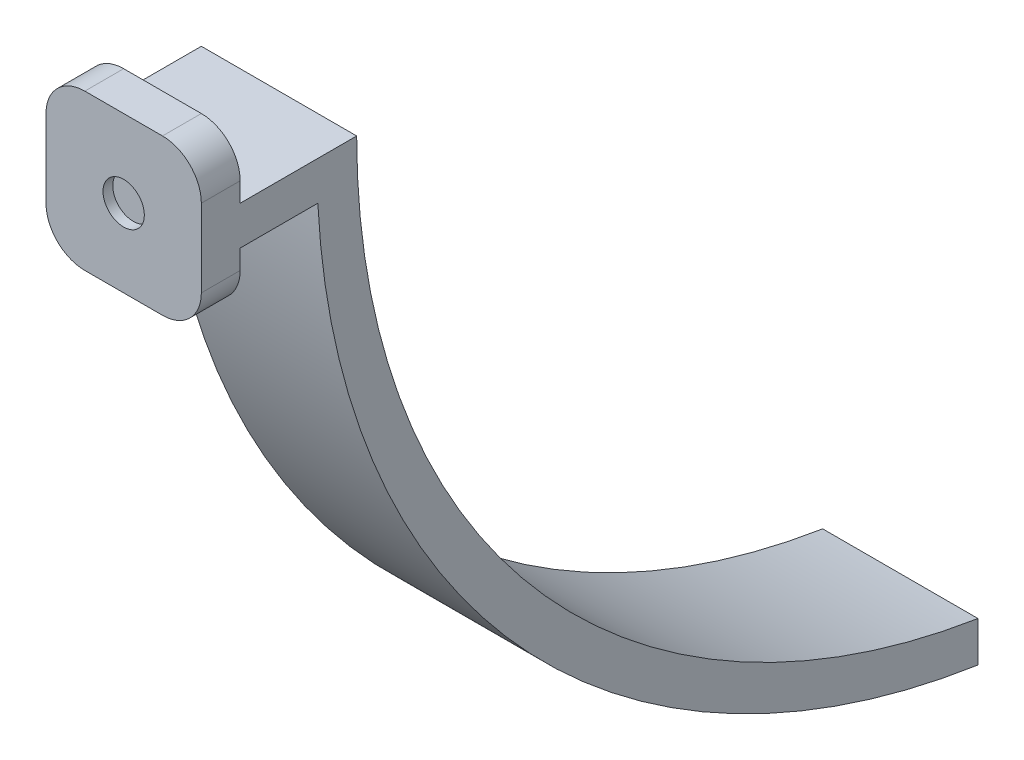
ISO-10303-21;
HEADER;
FILE_DESCRIPTION(('STEP AP214'),'2;1');
FILE_NAME('part.step','',(''),(''),'','','');
FILE_SCHEMA(('AUTOMOTIVE_DESIGN { 1 0 10303 214 1 1 1 1 }'));
ENDSEC;
DATA;
#1=APPLICATION_CONTEXT('core data for automotive mechanical design processes');
#2=APPLICATION_PROTOCOL_DEFINITION('international standard','automotive_design',2000,#1);
#3=PRODUCT_CONTEXT('',#1,'mechanical');
#4=PRODUCT('Part','Part','',(#3));
#5=PRODUCT_RELATED_PRODUCT_CATEGORY('part','',(#4));
#6=PRODUCT_DEFINITION_FORMATION('','',#4);
#7=PRODUCT_DEFINITION_CONTEXT('part definition',#1,'design');
#8=PRODUCT_DEFINITION('design','',#6,#7);
#9=PRODUCT_DEFINITION_SHAPE('','',#8);
#10=(LENGTH_UNIT() NAMED_UNIT(*) SI_UNIT(.MILLI.,.METRE.));
#11=(NAMED_UNIT(*) PLANE_ANGLE_UNIT() SI_UNIT($,.RADIAN.));
#12=(NAMED_UNIT(*) SI_UNIT($,.STERADIAN.) SOLID_ANGLE_UNIT());
#13=UNCERTAINTY_MEASURE_WITH_UNIT(LENGTH_MEASURE(1.E-05),#10,'distance_accuracy_value','');
#14=(GEOMETRIC_REPRESENTATION_CONTEXT(3) GLOBAL_UNCERTAINTY_ASSIGNED_CONTEXT((#13)) GLOBAL_UNIT_ASSIGNED_CONTEXT((#10,
#11,#12)) REPRESENTATION_CONTEXT('',''));
#15=CARTESIAN_POINT('',(0.,0.,0.));
#16=DIRECTION('',(0.,0.,1.));
#17=DIRECTION('',(1.,0.,0.));
#18=AXIS2_PLACEMENT_3D('',#15,#16,#17);
#19=CARTESIAN_POINT('',(12.7,0.,-6.35));
#20=DIRECTION('',(0.,1.,0.));
#21=DIRECTION('',(0.,0.,1.));
#22=AXIS2_PLACEMENT_3D('',#19,#20,#21);
#23=PLANE('',#22);
#24=DIRECTION('',(-1.,0.,0.));
#25=VECTOR('',#24,1.);
#26=CARTESIAN_POINT('',(12.7,0.,0.));
#27=LINE('',#26,#25);
#28=CARTESIAN_POINT('',(6.35,0.,0.));
#29=VERTEX_POINT('',#28);
#30=CARTESIAN_POINT('',(-6.35,0.,0.));
#31=VERTEX_POINT('',#30);
#32=EDGE_CURVE('E178',#29,#31,#27,.T.);
#33=ORIENTED_EDGE('',*,*,#32,.T.);
#34=DIRECTION('',(0.,0.,-1.));
#35=VECTOR('',#34,1.);
#36=CARTESIAN_POINT('',(-6.35,0.,-6.35));
#37=LINE('',#36,#35);
#38=CARTESIAN_POINT('',(-6.35,0.,-6.35));
#39=VERTEX_POINT('',#38);
#40=EDGE_CURVE('E218',#31,#39,#37,.T.);
#41=ORIENTED_EDGE('',*,*,#40,.T.);
#42=DIRECTION('',(-1.,0.,0.));
#43=VECTOR('',#42,1.);
#44=CARTESIAN_POINT('',(12.7,0.,-6.35));
#45=LINE('',#44,#43);
#46=CARTESIAN_POINT('',(6.35,0.,-6.35));
#47=VERTEX_POINT('',#46);
#48=EDGE_CURVE('E156',#47,#39,#45,.T.);
#49=ORIENTED_EDGE('',*,*,#48,.F.);
#50=DIRECTION('',(0.,0.,-1.));
#51=VECTOR('',#50,1.);
#52=CARTESIAN_POINT('',(6.35,0.,0.));
#53=LINE('',#52,#51);
#54=EDGE_CURVE('E216',#47,#29,#53,.F.);
#55=ORIENTED_EDGE('',*,*,#54,.T.);
#56=EDGE_LOOP('',(#33,#41,#49,#55));
#57=FACE_BOUND('',#56,.T.);
#58=ADVANCED_FACE('F35',(#57),#23,.F.);
#59=CARTESIAN_POINT('',(12.7,9.525,-6.34999999999999));
#60=DIRECTION('',(0.,0.,1.));
#61=DIRECTION('',(0.,-1.,0.));
#62=AXIS2_PLACEMENT_3D('',#59,#60,#61);
#63=PLANE('',#62);
#64=ORIENTED_EDGE('',*,*,#48,.T.);
#65=CARTESIAN_POINT('',(-6.35,6.35,-6.35));
#66=DIRECTION('',(0.,0.,1.));
#67=DIRECTION('',(0.,-1.,0.));
#68=AXIS2_PLACEMENT_3D('',#65,#66,#67);
#69=CIRCLE('',#68,6.35);
#70=CARTESIAN_POINT('',(-12.7,6.35,-6.35));
#71=VERTEX_POINT('',#70);
#72=EDGE_CURVE('E223',#39,#71,#69,.F.);
#73=ORIENTED_EDGE('',*,*,#72,.T.);
#74=DIRECTION('',(0.,1.,0.));
#75=VECTOR('',#74,1.);
#76=CARTESIAN_POINT('',(-12.7,9.525,-6.34999999999999));
#77=LINE('',#76,#75);
#78=CARTESIAN_POINT('',(-12.7,9.525,-6.34999999999999));
#79=VERTEX_POINT('',#78);
#80=EDGE_CURVE('E153',#71,#79,#77,.T.);
#81=ORIENTED_EDGE('',*,*,#80,.T.);
#82=DIRECTION('',(-1.,0.,0.));
#83=VECTOR('',#82,1.);
#84=CARTESIAN_POINT('',(12.7,9.525,-6.34999999999999));
#85=LINE('',#84,#83);
#86=CARTESIAN_POINT('',(12.7,9.525,-6.34999999999999));
#87=VERTEX_POINT('',#86);
#88=EDGE_CURVE('E149',#87,#79,#85,.T.);
#89=ORIENTED_EDGE('',*,*,#88,.F.);
#90=DIRECTION('',(0.,1.,0.));
#91=VECTOR('',#90,1.);
#92=CARTESIAN_POINT('',(12.7,9.525,-6.34999999999999));
#93=LINE('',#92,#91);
#94=CARTESIAN_POINT('',(12.7,6.35,-6.35));
#95=VERTEX_POINT('',#94);
#96=EDGE_CURVE('E136',#95,#87,#93,.T.);
#97=ORIENTED_EDGE('',*,*,#96,.F.);
#98=CARTESIAN_POINT('',(6.35,6.35,-6.34999999999999));
#99=DIRECTION('',(0.,0.,1.));
#100=DIRECTION('',(0.,-1.,0.));
#101=AXIS2_PLACEMENT_3D('',#98,#99,#100);
#102=CIRCLE('',#101,6.35);
#103=EDGE_CURVE('E221',#95,#47,#102,.F.);
#104=ORIENTED_EDGE('',*,*,#103,.T.);
#105=EDGE_LOOP('',(#64,#73,#81,#89,#97,#104));
#106=FACE_BOUND('',#105,.T.);
#107=ADVANCED_FACE('F151',(#106),#63,.F.);
#108=CARTESIAN_POINT('',(12.7,9.525,-6.34999999999999));
#109=DIRECTION('',(0.,1.,0.));
#110=DIRECTION('',(0.,0.,1.));
#111=AXIS2_PLACEMENT_3D('',#108,#109,#110);
#112=PLANE('',#111);
#113=DIRECTION('',(0.,0.,-1.));
#114=VECTOR('',#113,1.);
#115=CARTESIAN_POINT('',(-12.7,9.525,-6.34999999999999));
#116=LINE('',#115,#114);
#117=CARTESIAN_POINT('',(-12.7,9.52500000000005,-19.05));
#118=VERTEX_POINT('',#117);
#119=EDGE_CURVE('E180',#79,#118,#116,.T.);
#120=ORIENTED_EDGE('',*,*,#119,.T.);
#121=DIRECTION('',(-1.,0.,0.));
#122=VECTOR('',#121,1.);
#123=CARTESIAN_POINT('',(12.7,9.52500000000005,-19.05));
#124=LINE('',#123,#122);
#125=CARTESIAN_POINT('',(12.7,9.52500000000005,-19.05));
#126=VERTEX_POINT('',#125);
#127=EDGE_CURVE('E157',#126,#118,#124,.T.);
#128=ORIENTED_EDGE('',*,*,#127,.F.);
#129=DIRECTION('',(0.,0.,-1.));
#130=VECTOR('',#129,1.);
#131=CARTESIAN_POINT('',(12.7,9.525,-6.34999999999999));
#132=LINE('',#131,#130);
#133=EDGE_CURVE('E141',#87,#126,#132,.T.);
#134=ORIENTED_EDGE('',*,*,#133,.F.);
#135=ORIENTED_EDGE('',*,*,#88,.T.);
#136=EDGE_LOOP('',(#120,#128,#134,#135));
#137=FACE_BOUND('',#136,.T.);
#138=ADVANCED_FACE('F159',(#137),#112,.F.);
#139=CARTESIAN_POINT('',(12.7,15.875,-146.05));
#140=DIRECTION('',(-1.,0.,0.));
#141=DIRECTION('',(0.,0.,1.));
#142=AXIS2_PLACEMENT_3D('',#139,#140,#141);
#143=CYLINDRICAL_SURFACE('',#142,127.15865090508);
#144=CARTESIAN_POINT('',(-12.7,15.875,-146.05));
#145=DIRECTION('',(1.,0.,0.));
#146=DIRECTION('',(0.,0.,-1.));
#147=AXIS2_PLACEMENT_3D('',#144,#145,#146);
#148=CIRCLE('',#147,127.15865090508);
#149=CARTESIAN_POINT('',(-12.7,-109.848585694968,-127.));
#150=VERTEX_POINT('',#149);
#151=EDGE_CURVE('E183',#118,#150,#148,.T.);
#152=ORIENTED_EDGE('',*,*,#151,.T.);
#153=DIRECTION('',(-1.,0.,0.));
#154=VECTOR('',#153,1.);
#155=CARTESIAN_POINT('',(12.7,-109.848585694968,-127.));
#156=LINE('',#155,#154);
#157=CARTESIAN_POINT('',(12.7,-109.848585694968,-127.));
#158=VERTEX_POINT('',#157);
#159=EDGE_CURVE('E211',#158,#150,#156,.T.);
#160=ORIENTED_EDGE('',*,*,#159,.F.);
#161=CARTESIAN_POINT('',(12.7,15.875,-146.05));
#162=DIRECTION('',(1.,0.,0.));
#163=DIRECTION('',(0.,0.,-1.));
#164=AXIS2_PLACEMENT_3D('',#161,#162,#163);
#165=CIRCLE('',#164,127.15865090508);
#166=EDGE_CURVE('E162',#126,#158,#165,.T.);
#167=ORIENTED_EDGE('',*,*,#166,.F.);
#168=ORIENTED_EDGE('',*,*,#127,.T.);
#169=EDGE_LOOP('',(#152,#160,#167,#168));
#170=FACE_BOUND('',#169,.T.);
#171=ADVANCED_FACE('F299',(#170),#143,.T.);
#172=CARTESIAN_POINT('',(12.7,-103.261560299515,-127.));
#173=DIRECTION('',(0.,0.,1.));
#174=DIRECTION('',(1.,0.,0.));
#175=AXIS2_PLACEMENT_3D('',#172,#173,#174);
#176=PLANE('',#175);
#177=DIRECTION('',(0.,1.,0.));
#178=VECTOR('',#177,1.);
#179=CARTESIAN_POINT('',(-12.7,-103.261560299515,-127.));
#180=LINE('',#179,#178);
#181=CARTESIAN_POINT('',(-12.7,-103.261560299515,-127.));
#182=VERTEX_POINT('',#181);
#183=EDGE_CURVE('E185',#150,#182,#180,.T.);
#184=ORIENTED_EDGE('',*,*,#183,.T.);
#185=DIRECTION('',(-1.,0.,0.));
#186=VECTOR('',#185,1.);
#187=CARTESIAN_POINT('',(12.7,-103.261560299515,-127.));
#188=LINE('',#187,#186);
#189=CARTESIAN_POINT('',(12.7,-103.261560299515,-127.));
#190=VERTEX_POINT('',#189);
#191=EDGE_CURVE('E208',#190,#182,#188,.T.);
#192=ORIENTED_EDGE('',*,*,#191,.F.);
#193=DIRECTION('',(0.,1.,0.));
#194=VECTOR('',#193,1.);
#195=CARTESIAN_POINT('',(12.7,-103.261560299515,-127.));
#196=LINE('',#195,#194);
#197=EDGE_CURVE('E164',#158,#190,#196,.T.);
#198=ORIENTED_EDGE('',*,*,#197,.F.);
#199=ORIENTED_EDGE('',*,*,#159,.T.);
#200=EDGE_LOOP('',(#184,#192,#198,#199));
#201=FACE_BOUND('',#200,.T.);
#202=ADVANCED_FACE('F306',(#201),#176,.F.);
#203=CARTESIAN_POINT('',(12.7,15.875,-146.05));
#204=DIRECTION('',(-1.,0.,0.));
#205=DIRECTION('',(0.,0.,1.));
#206=AXIS2_PLACEMENT_3D('',#203,#204,#205);
#207=CYLINDRICAL_SURFACE('',#206,120.65);
#208=CARTESIAN_POINT('',(-12.7,15.875,-146.05));
#209=DIRECTION('',(-1.,0.,0.));
#210=DIRECTION('',(0.,0.,-1.));
#211=AXIS2_PLACEMENT_3D('',#208,#209,#210);
#212=CIRCLE('',#211,120.65);
#213=CARTESIAN_POINT('',(-12.7,15.875,-25.4));
#214=VERTEX_POINT('',#213);
#215=EDGE_CURVE('E187',#182,#214,#212,.T.);
#216=ORIENTED_EDGE('',*,*,#215,.T.);
#217=DIRECTION('',(-1.,0.,0.));
#218=VECTOR('',#217,1.);
#219=CARTESIAN_POINT('',(12.7,15.875,-25.4));
#220=LINE('',#219,#218);
#221=CARTESIAN_POINT('',(12.7,15.875,-25.4));
#222=VERTEX_POINT('',#221);
#223=EDGE_CURVE('E205',#222,#214,#220,.T.);
#224=ORIENTED_EDGE('',*,*,#223,.F.);
#225=CARTESIAN_POINT('',(12.7,15.875,-146.05));
#226=DIRECTION('',(-1.,0.,0.));
#227=DIRECTION('',(0.,0.,-1.));
#228=AXIS2_PLACEMENT_3D('',#225,#226,#227);
#229=CIRCLE('',#228,120.65);
#230=EDGE_CURVE('E169',#190,#222,#229,.T.);
#231=ORIENTED_EDGE('',*,*,#230,.F.);
#232=ORIENTED_EDGE('',*,*,#191,.T.);
#233=EDGE_LOOP('',(#216,#224,#231,#232));
#234=FACE_BOUND('',#233,.T.);
#235=ADVANCED_FACE('F308',(#234),#207,.F.);
#236=CARTESIAN_POINT('',(12.7,15.875,-6.34999999999999));
#237=DIRECTION('',(0.,-1.,0.));
#238=DIRECTION('',(0.,0.,-1.));
#239=AXIS2_PLACEMENT_3D('',#236,#237,#238);
#240=PLANE('',#239);
#241=DIRECTION('',(0.,0.,1.));
#242=VECTOR('',#241,1.);
#243=CARTESIAN_POINT('',(-12.7,15.875,-6.34999999999999));
#244=LINE('',#243,#242);
#245=CARTESIAN_POINT('',(-12.7,15.875,-6.34999999999999));
#246=VERTEX_POINT('',#245);
#247=EDGE_CURVE('E189',#214,#246,#244,.T.);
#248=ORIENTED_EDGE('',*,*,#247,.T.);
#249=DIRECTION('',(-1.,0.,0.));
#250=VECTOR('',#249,1.);
#251=CARTESIAN_POINT('',(12.7,15.875,-6.34999999999999));
#252=LINE('',#251,#250);
#253=CARTESIAN_POINT('',(12.7,15.875,-6.34999999999999));
#254=VERTEX_POINT('',#253);
#255=EDGE_CURVE('E202',#254,#246,#252,.T.);
#256=ORIENTED_EDGE('',*,*,#255,.F.);
#257=DIRECTION('',(0.,0.,1.));
#258=VECTOR('',#257,1.);
#259=CARTESIAN_POINT('',(12.7,15.875,-6.34999999999999));
#260=LINE('',#259,#258);
#261=EDGE_CURVE('E171',#222,#254,#260,.T.);
#262=ORIENTED_EDGE('',*,*,#261,.F.);
#263=ORIENTED_EDGE('',*,*,#223,.T.);
#264=EDGE_LOOP('',(#248,#256,#262,#263));
#265=FACE_BOUND('',#264,.T.);
#266=ADVANCED_FACE('F309',(#265),#240,.F.);
#267=CARTESIAN_POINT('',(12.7,25.4,-6.34999999999999));
#268=DIRECTION('',(0.,0.,1.));
#269=DIRECTION('',(1.,0.,0.));
#270=AXIS2_PLACEMENT_3D('',#267,#268,#269);
#271=PLANE('',#270);
#272=DIRECTION('',(-1.,0.,0.));
#273=VECTOR('',#272,1.);
#274=CARTESIAN_POINT('',(12.7,25.4,-6.34999999999999));
#275=LINE('',#274,#273);
#276=CARTESIAN_POINT('',(6.35,25.4,-6.34999999999999));
#277=VERTEX_POINT('',#276);
#278=CARTESIAN_POINT('',(-6.35,25.4,-6.34999999999999));
#279=VERTEX_POINT('',#278);
#280=EDGE_CURVE('E200',#277,#279,#275,.T.);
#281=ORIENTED_EDGE('',*,*,#280,.F.);
#282=CARTESIAN_POINT('',(6.35,19.05,-6.34999999999999));
#283=DIRECTION('',(0.,0.,1.));
#284=DIRECTION('',(1.,0.,0.));
#285=AXIS2_PLACEMENT_3D('',#282,#283,#284);
#286=CIRCLE('',#285,6.35);
#287=CARTESIAN_POINT('',(12.7,19.05,-6.34999999999999));
#288=VERTEX_POINT('',#287);
#289=EDGE_CURVE('E11',#277,#288,#286,.F.);
#290=ORIENTED_EDGE('',*,*,#289,.T.);
#291=DIRECTION('',(0.,1.,0.));
#292=VECTOR('',#291,1.);
#293=CARTESIAN_POINT('',(12.7,25.4,-6.34999999999999));
#294=LINE('',#293,#292);
#295=EDGE_CURVE('E173',#254,#288,#294,.T.);
#296=ORIENTED_EDGE('',*,*,#295,.F.);
#297=ORIENTED_EDGE('',*,*,#255,.T.);
#298=DIRECTION('',(0.,1.,0.));
#299=VECTOR('',#298,1.);
#300=CARTESIAN_POINT('',(-12.7,25.4,-6.34999999999999));
#301=LINE('',#300,#299);
#302=CARTESIAN_POINT('',(-12.7,19.05,-6.34999999999999));
#303=VERTEX_POINT('',#302);
#304=EDGE_CURVE('E191',#246,#303,#301,.T.);
#305=ORIENTED_EDGE('',*,*,#304,.T.);
#306=CARTESIAN_POINT('',(-6.35,19.05,-6.34999999999999));
#307=DIRECTION('',(0.,0.,1.));
#308=DIRECTION('',(1.,0.,0.));
#309=AXIS2_PLACEMENT_3D('',#306,#307,#308);
#310=CIRCLE('',#309,6.35);
#311=EDGE_CURVE('E43',#303,#279,#310,.F.);
#312=ORIENTED_EDGE('',*,*,#311,.T.);
#313=EDGE_LOOP('',(#281,#290,#296,#297,#305,#312));
#314=FACE_BOUND('',#313,.T.);
#315=ADVANCED_FACE('F258',(#314),#271,.F.);
#316=CARTESIAN_POINT('',(12.7,25.4,0.));
#317=DIRECTION('',(0.,-1.,0.));
#318=DIRECTION('',(0.,0.,-1.));
#319=AXIS2_PLACEMENT_3D('',#316,#317,#318);
#320=PLANE('',#319);
#321=DIRECTION('',(-1.,0.,0.));
#322=VECTOR('',#321,1.);
#323=CARTESIAN_POINT('',(12.7,25.4,0.));
#324=LINE('',#323,#322);
#325=CARTESIAN_POINT('',(6.35,25.4,0.));
#326=VERTEX_POINT('',#325);
#327=CARTESIAN_POINT('',(-6.35,25.4,0.));
#328=VERTEX_POINT('',#327);
#329=EDGE_CURVE('E197',#326,#328,#324,.T.);
#330=ORIENTED_EDGE('',*,*,#329,.F.);
#331=DIRECTION('',(0.,0.,1.));
#332=VECTOR('',#331,1.);
#333=CARTESIAN_POINT('',(6.35,25.4,-6.34999999999999));
#334=LINE('',#333,#332);
#335=EDGE_CURVE('E56',#326,#277,#334,.F.);
#336=ORIENTED_EDGE('',*,*,#335,.T.);
#337=ORIENTED_EDGE('',*,*,#280,.T.);
#338=DIRECTION('',(0.,0.,1.));
#339=VECTOR('',#338,1.);
#340=CARTESIAN_POINT('',(-6.35,25.4,0.));
#341=LINE('',#340,#339);
#342=EDGE_CURVE('E241',#279,#328,#341,.T.);
#343=ORIENTED_EDGE('',*,*,#342,.T.);
#344=EDGE_LOOP('',(#330,#336,#337,#343));
#345=FACE_BOUND('',#344,.T.);
#346=ADVANCED_FACE('F245',(#345),#320,.F.);
#347=CARTESIAN_POINT('',(12.7,0.,0.));
#348=DIRECTION('',(0.,0.,-1.));
#349=DIRECTION('',(-1.,0.,0.));
#350=AXIS2_PLACEMENT_3D('',#347,#348,#349);
#351=PLANE('',#350);
#352=CARTESIAN_POINT('',(0.,12.7,0.));
#353=DIRECTION('',(0.,0.,1.));
#354=DIRECTION('',(1.,0.,0.));
#355=AXIS2_PLACEMENT_3D('',#352,#353,#354);
#356=CIRCLE('',#355,3.3782);
#357=CARTESIAN_POINT('',(3.3782,12.7,0.));
#358=VERTEX_POINT('',#357);
#359=EDGE_CURVE('E435',#358,#358,#356,.T.);
#360=ORIENTED_EDGE('',*,*,#359,.F.);
#361=EDGE_LOOP('',(#360));
#362=FACE_BOUND('',#361,.T.);
#363=DIRECTION('',(0.,-1.,0.));
#364=VECTOR('',#363,1.);
#365=CARTESIAN_POINT('',(-12.7,0.,0.));
#366=LINE('',#365,#364);
#367=CARTESIAN_POINT('',(-12.7,19.05,0.));
#368=VERTEX_POINT('',#367);
#369=CARTESIAN_POINT('',(-12.7,6.35,0.));
#370=VERTEX_POINT('',#369);
#371=EDGE_CURVE('E146',#368,#370,#366,.T.);
#372=ORIENTED_EDGE('',*,*,#371,.T.);
#373=CARTESIAN_POINT('',(-6.35,6.35,0.));
#374=DIRECTION('',(0.,0.,-1.));
#375=DIRECTION('',(-1.,0.,0.));
#376=AXIS2_PLACEMENT_3D('',#373,#374,#375);
#377=CIRCLE('',#376,6.35);
#378=EDGE_CURVE('E235',#370,#31,#377,.F.);
#379=ORIENTED_EDGE('',*,*,#378,.T.);
#380=ORIENTED_EDGE('',*,*,#32,.F.);
#381=CARTESIAN_POINT('',(6.35,6.35,0.));
#382=DIRECTION('',(0.,0.,-1.));
#383=DIRECTION('',(-1.,0.,0.));
#384=AXIS2_PLACEMENT_3D('',#381,#382,#383);
#385=CIRCLE('',#384,6.35);
#386=CARTESIAN_POINT('',(12.7,6.35,0.));
#387=VERTEX_POINT('',#386);
#388=EDGE_CURVE('E233',#29,#387,#385,.F.);
#389=ORIENTED_EDGE('',*,*,#388,.T.);
#390=DIRECTION('',(0.,-1.,0.));
#391=VECTOR('',#390,1.);
#392=CARTESIAN_POINT('',(12.7,0.,0.));
#393=LINE('',#392,#391);
#394=CARTESIAN_POINT('',(12.7,19.05,0.));
#395=VERTEX_POINT('',#394);
#396=EDGE_CURVE('E176',#395,#387,#393,.T.);
#397=ORIENTED_EDGE('',*,*,#396,.F.);
#398=CARTESIAN_POINT('',(6.35,19.05,0.));
#399=DIRECTION('',(0.,0.,-1.));
#400=DIRECTION('',(-1.,0.,0.));
#401=AXIS2_PLACEMENT_3D('',#398,#399,#400);
#402=CIRCLE('',#401,6.35);
#403=EDGE_CURVE('E231',#395,#326,#402,.F.);
#404=ORIENTED_EDGE('',*,*,#403,.T.);
#405=ORIENTED_EDGE('',*,*,#329,.T.);
#406=CARTESIAN_POINT('',(-6.35,19.05,0.));
#407=DIRECTION('',(0.,0.,-1.));
#408=DIRECTION('',(-1.,0.,0.));
#409=AXIS2_PLACEMENT_3D('',#406,#407,#408);
#410=CIRCLE('',#409,6.35);
#411=EDGE_CURVE('E229',#328,#368,#410,.F.);
#412=ORIENTED_EDGE('',*,*,#411,.T.);
#413=EDGE_LOOP('',(#372,#379,#380,#389,#397,#404,#405,#412));
#414=FACE_BOUND('',#413,.T.);
#415=ADVANCED_FACE('F248',(#362,#414),#351,.F.);
#416=CARTESIAN_POINT('',(12.7,15.875,-146.05));
#417=DIRECTION('',(1.,0.,0.));
#418=DIRECTION('',(0.,0.,-1.));
#419=AXIS2_PLACEMENT_3D('',#416,#417,#418);
#420=PLANE('',#419);
#421=ORIENTED_EDGE('',*,*,#396,.T.);
#422=DIRECTION('',(0.,0.,-1.));
#423=VECTOR('',#422,1.);
#424=CARTESIAN_POINT('',(12.7,6.35,-6.34999999999999));
#425=LINE('',#424,#423);
#426=EDGE_CURVE('E144',#387,#95,#425,.T.);
#427=ORIENTED_EDGE('',*,*,#426,.T.);
#428=ORIENTED_EDGE('',*,*,#96,.T.);
#429=ORIENTED_EDGE('',*,*,#133,.T.);
#430=ORIENTED_EDGE('',*,*,#166,.T.);
#431=ORIENTED_EDGE('',*,*,#197,.T.);
#432=ORIENTED_EDGE('',*,*,#230,.T.);
#433=ORIENTED_EDGE('',*,*,#261,.T.);
#434=ORIENTED_EDGE('',*,*,#295,.T.);
#435=DIRECTION('',(0.,0.,1.));
#436=VECTOR('',#435,1.);
#437=CARTESIAN_POINT('',(12.7,19.05,0.));
#438=LINE('',#437,#436);
#439=EDGE_CURVE('E237',#288,#395,#438,.T.);
#440=ORIENTED_EDGE('',*,*,#439,.T.);
#441=EDGE_LOOP('',(#421,#427,#428,#429,#430,#431,#432,#433,#434,#440));
#442=FACE_BOUND('',#441,.T.);
#443=ADVANCED_FACE('F139',(#442),#420,.T.);
#444=CARTESIAN_POINT('',(-12.7,15.875,-146.05));
#445=DIRECTION('',(1.,0.,0.));
#446=DIRECTION('',(0.,0.,-1.));
#447=AXIS2_PLACEMENT_3D('',#444,#445,#446);
#448=PLANE('',#447);
#449=ORIENTED_EDGE('',*,*,#80,.F.);
#450=DIRECTION('',(0.,0.,-1.));
#451=VECTOR('',#450,1.);
#452=CARTESIAN_POINT('',(-12.7,6.34999999999993,-146.05));
#453=LINE('',#452,#451);
#454=EDGE_CURVE('E227',#71,#370,#453,.F.);
#455=ORIENTED_EDGE('',*,*,#454,.T.);
#456=ORIENTED_EDGE('',*,*,#371,.F.);
#457=DIRECTION('',(0.,0.,1.));
#458=VECTOR('',#457,1.);
#459=CARTESIAN_POINT('',(-12.7,19.05,-146.05));
#460=LINE('',#459,#458);
#461=EDGE_CURVE('E225',#368,#303,#460,.F.);
#462=ORIENTED_EDGE('',*,*,#461,.T.);
#463=ORIENTED_EDGE('',*,*,#304,.F.);
#464=ORIENTED_EDGE('',*,*,#247,.F.);
#465=ORIENTED_EDGE('',*,*,#215,.F.);
#466=ORIENTED_EDGE('',*,*,#183,.F.);
#467=ORIENTED_EDGE('',*,*,#151,.F.);
#468=ORIENTED_EDGE('',*,*,#119,.F.);
#469=EDGE_LOOP('',(#449,#455,#456,#462,#463,#464,#465,#466,#467,#468));
#470=FACE_BOUND('',#469,.T.);
#471=ADVANCED_FACE('F263',(#470),#448,.F.);
#472=CARTESIAN_POINT('',(0.,12.7,-1.5875));
#473=DIRECTION('',(0.,0.,1.));
#474=DIRECTION('',(1.,0.,0.));
#475=AXIS2_PLACEMENT_3D('',#472,#473,#474);
#476=CYLINDRICAL_SURFACE('',#475,3.3782);
#477=CARTESIAN_POINT('',(0.,12.7,-1.5875));
#478=DIRECTION('',(0.,0.,1.));
#479=DIRECTION('',(1.,0.,0.));
#480=AXIS2_PLACEMENT_3D('',#477,#478,#479);
#481=CIRCLE('',#480,3.3782);
#482=CARTESIAN_POINT('',(3.3782,12.7,-1.5875));
#483=VERTEX_POINT('',#482);
#484=EDGE_CURVE('E181',#483,#483,#481,.T.);
#485=ORIENTED_EDGE('',*,*,#484,.F.);
#486=EDGE_LOOP('',(#485));
#487=FACE_BOUND('',#486,.T.);
#488=ORIENTED_EDGE('',*,*,#359,.T.);
#489=EDGE_LOOP('',(#488));
#490=FACE_BOUND('',#489,.T.);
#491=ADVANCED_FACE('F350',(#487,#490),#476,.F.);
#492=CARTESIAN_POINT('',(0.,12.7,-1.5875));
#493=DIRECTION('',(0.,0.,1.));
#494=DIRECTION('',(1.,0.,0.));
#495=AXIS2_PLACEMENT_3D('',#492,#493,#494);
#496=PLANE('',#495);
#497=ORIENTED_EDGE('',*,*,#484,.T.);
#498=EDGE_LOOP('',(#497));
#499=FACE_BOUND('',#498,.T.);
#500=ADVANCED_FACE('F283',(#499),#496,.T.);
#501=CARTESIAN_POINT('',(-6.35,6.35,-6.35));
#502=DIRECTION('',(0.,0.,-1.));
#503=DIRECTION('',(0.,1.,0.));
#504=AXIS2_PLACEMENT_3D('',#501,#502,#503);
#505=CYLINDRICAL_SURFACE('',#504,6.35);
#506=ORIENTED_EDGE('',*,*,#378,.F.);
#507=ORIENTED_EDGE('',*,*,#454,.F.);
#508=ORIENTED_EDGE('',*,*,#72,.F.);
#509=ORIENTED_EDGE('',*,*,#40,.F.);
#510=EDGE_LOOP('',(#506,#507,#508,#509));
#511=FACE_BOUND('',#510,.T.);
#512=ADVANCED_FACE('F280',(#511),#505,.T.);
#513=CARTESIAN_POINT('',(6.35,6.34999999999993,-146.05));
#514=DIRECTION('',(0.,0.,1.));
#515=DIRECTION('',(0.,-1.,0.));
#516=AXIS2_PLACEMENT_3D('',#513,#514,#515);
#517=CYLINDRICAL_SURFACE('',#516,6.35);
#518=ORIENTED_EDGE('',*,*,#388,.F.);
#519=ORIENTED_EDGE('',*,*,#54,.F.);
#520=ORIENTED_EDGE('',*,*,#103,.F.);
#521=ORIENTED_EDGE('',*,*,#426,.F.);
#522=EDGE_LOOP('',(#518,#519,#520,#521));
#523=FACE_BOUND('',#522,.T.);
#524=ADVANCED_FACE('F270',(#523),#517,.T.);
#525=CARTESIAN_POINT('',(6.35,19.05,-146.05));
#526=DIRECTION('',(0.,0.,-1.));
#527=DIRECTION('',(-1.,0.,0.));
#528=AXIS2_PLACEMENT_3D('',#525,#526,#527);
#529=CYLINDRICAL_SURFACE('',#528,6.35);
#530=ORIENTED_EDGE('',*,*,#289,.F.);
#531=ORIENTED_EDGE('',*,*,#335,.F.);
#532=ORIENTED_EDGE('',*,*,#403,.F.);
#533=ORIENTED_EDGE('',*,*,#439,.F.);
#534=EDGE_LOOP('',(#530,#531,#532,#533));
#535=FACE_BOUND('',#534,.T.);
#536=ADVANCED_FACE('F254',(#535),#529,.T.);
#537=CARTESIAN_POINT('',(-6.35,19.05,0.));
#538=DIRECTION('',(0.,0.,1.));
#539=DIRECTION('',(1.,0.,0.));
#540=AXIS2_PLACEMENT_3D('',#537,#538,#539);
#541=CYLINDRICAL_SURFACE('',#540,6.35);
#542=ORIENTED_EDGE('',*,*,#311,.F.);
#543=ORIENTED_EDGE('',*,*,#461,.F.);
#544=ORIENTED_EDGE('',*,*,#411,.F.);
#545=ORIENTED_EDGE('',*,*,#342,.F.);
#546=EDGE_LOOP('',(#542,#543,#544,#545));
#547=FACE_BOUND('',#546,.T.);
#548=ADVANCED_FACE('F37',(#547),#541,.T.);
#549=CLOSED_SHELL('',(#58,#107,#138,#171,#202,#235,#266,#315,#346,#415,#443,#471,#491,#500,#512,
#524,#536,#548));
#550=MANIFOLD_SOLID_BREP('B2',#549);
#551=ADVANCED_BREP_SHAPE_REPRESENTATION('',(#18,#550),#14);
#552=SHAPE_DEFINITION_REPRESENTATION(#9,#551);
ENDSEC;
END-ISO-10303-21;
